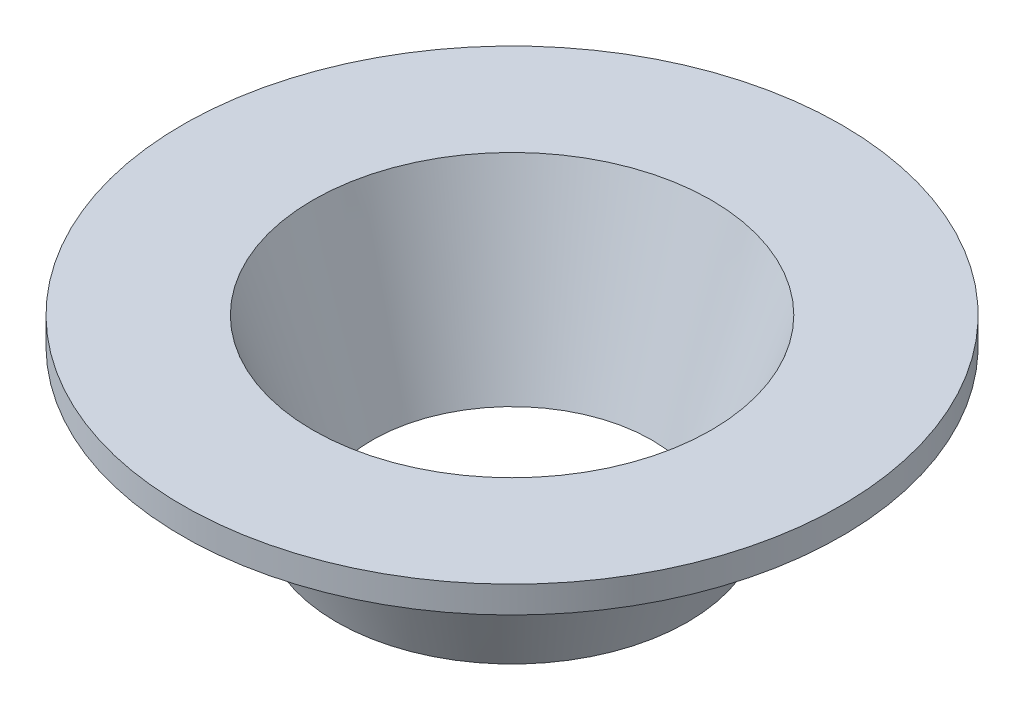
ISO-10303-21;
HEADER;
FILE_DESCRIPTION(('STEP AP214'),'2;1');
FILE_NAME('part.step','',(''),(''),'','','');
FILE_SCHEMA(('AUTOMOTIVE_DESIGN { 1 0 10303 214 1 1 1 1 }'));
ENDSEC;
DATA;
#1=APPLICATION_CONTEXT('core data for automotive mechanical design processes');
#2=APPLICATION_PROTOCOL_DEFINITION('international standard','automotive_design',2000,#1);
#3=PRODUCT_CONTEXT('',#1,'mechanical');
#4=PRODUCT('Part','Part','',(#3));
#5=PRODUCT_RELATED_PRODUCT_CATEGORY('part','',(#4));
#6=PRODUCT_DEFINITION_FORMATION('','',#4);
#7=PRODUCT_DEFINITION_CONTEXT('part definition',#1,'design');
#8=PRODUCT_DEFINITION('design','',#6,#7);
#9=PRODUCT_DEFINITION_SHAPE('','',#8);
#10=(LENGTH_UNIT() NAMED_UNIT(*) SI_UNIT(.MILLI.,.METRE.));
#11=(NAMED_UNIT(*) PLANE_ANGLE_UNIT() SI_UNIT($,.RADIAN.));
#12=(NAMED_UNIT(*) SI_UNIT($,.STERADIAN.) SOLID_ANGLE_UNIT());
#13=UNCERTAINTY_MEASURE_WITH_UNIT(LENGTH_MEASURE(1.E-05),#10,'distance_accuracy_value','');
#14=(GEOMETRIC_REPRESENTATION_CONTEXT(3) GLOBAL_UNCERTAINTY_ASSIGNED_CONTEXT((#13)) GLOBAL_UNIT_ASSIGNED_CONTEXT((#10,
#11,#12)) REPRESENTATION_CONTEXT('',''));
#15=CARTESIAN_POINT('',(0.,0.,0.));
#16=DIRECTION('',(0.,0.,1.));
#17=DIRECTION('',(1.,0.,0.));
#18=AXIS2_PLACEMENT_3D('',#15,#16,#17);
#19=CARTESIAN_POINT('',(5.85,0.,0.));
#20=DIRECTION('',(0.,1.,0.));
#21=DIRECTION('',(0.,0.,1.));
#22=AXIS2_PLACEMENT_3D('',#19,#20,#21);
#23=CONICAL_SURFACE('',#22,7.85,0.321750554396642);
#24=CARTESIAN_POINT('',(5.85,10.,0.));
#25=DIRECTION('',(0.,-1.,0.));
#26=DIRECTION('',(0.,0.,-1.));
#27=AXIS2_PLACEMENT_3D('',#24,#25,#26);
#28=CIRCLE('',#27,11.1833333333333);
#29=CARTESIAN_POINT('',(5.85,10.,-11.1833333333333));
#30=VERTEX_POINT('',#29);
#31=EDGE_CURVE('E59',#30,#30,#28,.T.);
#32=ORIENTED_EDGE('',*,*,#31,.F.);
#33=EDGE_LOOP('',(#32));
#34=FACE_BOUND('',#33,.T.);
#35=CARTESIAN_POINT('',(5.85,0.,0.));
#36=DIRECTION('',(0.,-1.,0.));
#37=DIRECTION('',(0.,0.,-1.));
#38=AXIS2_PLACEMENT_3D('',#35,#36,#37);
#39=CIRCLE('',#38,7.85);
#40=CARTESIAN_POINT('',(5.85,0.,-7.85));
#41=VERTEX_POINT('',#40);
#42=EDGE_CURVE('E10',#41,#41,#39,.T.);
#43=ORIENTED_EDGE('',*,*,#42,.T.);
#44=EDGE_LOOP('',(#43));
#45=FACE_BOUND('',#44,.T.);
#46=ADVANCED_FACE('F37',(#34,#45),#23,.F.);
#47=CARTESIAN_POINT('',(-2.,0.,0.));
#48=DIRECTION('',(0.,1.,0.));
#49=DIRECTION('',(0.,0.,1.));
#50=AXIS2_PLACEMENT_3D('',#47,#48,#49);
#51=PLANE('',#50);
#52=ORIENTED_EDGE('',*,*,#42,.F.);
#53=EDGE_LOOP('',(#52));
#54=FACE_BOUND('',#53,.T.);
#55=CARTESIAN_POINT('',(5.85,0.,0.));
#56=DIRECTION('',(0.,-1.,0.));
#57=DIRECTION('',(0.,0.,-1.));
#58=AXIS2_PLACEMENT_3D('',#55,#56,#57);
#59=CIRCLE('',#58,9.85);
#60=CARTESIAN_POINT('',(5.85,0.,-9.85));
#61=VERTEX_POINT('',#60);
#62=EDGE_CURVE('E43',#61,#61,#59,.T.);
#63=ORIENTED_EDGE('',*,*,#62,.T.);
#64=EDGE_LOOP('',(#63));
#65=FACE_BOUND('',#64,.T.);
#66=ADVANCED_FACE('F66',(#54,#65),#51,.F.);
#67=CARTESIAN_POINT('',(5.85,8.5,0.));
#68=DIRECTION('',(0.,1.,0.));
#69=DIRECTION('',(0.,0.,1.));
#70=AXIS2_PLACEMENT_3D('',#67,#68,#69);
#71=CONICAL_SURFACE('',#70,13.,0.354897222889823);
#72=ORIENTED_EDGE('',*,*,#62,.F.);
#73=EDGE_LOOP('',(#72));
#74=FACE_BOUND('',#73,.T.);
#75=CARTESIAN_POINT('',(5.85,8.5,0.));
#76=DIRECTION('',(0.,-1.,0.));
#77=DIRECTION('',(0.,0.,-1.));
#78=AXIS2_PLACEMENT_3D('',#75,#76,#77);
#79=CIRCLE('',#78,13.);
#80=CARTESIAN_POINT('',(5.85,8.5,-13.));
#81=VERTEX_POINT('',#80);
#82=EDGE_CURVE('E47',#81,#81,#79,.T.);
#83=ORIENTED_EDGE('',*,*,#82,.T.);
#84=EDGE_LOOP('',(#83));
#85=FACE_BOUND('',#84,.T.);
#86=ADVANCED_FACE('F70',(#74,#85),#71,.T.);
#87=CARTESIAN_POINT('',(-7.15,8.5,0.));
#88=DIRECTION('',(0.,1.,0.));
#89=DIRECTION('',(0.,0.,1.));
#90=AXIS2_PLACEMENT_3D('',#87,#88,#89);
#91=PLANE('',#90);
#92=ORIENTED_EDGE('',*,*,#82,.F.);
#93=EDGE_LOOP('',(#92));
#94=FACE_BOUND('',#93,.T.);
#95=CARTESIAN_POINT('',(5.85,8.5,0.));
#96=DIRECTION('',(0.,-1.,0.));
#97=DIRECTION('',(0.,0.,-1.));
#98=AXIS2_PLACEMENT_3D('',#95,#96,#97);
#99=CIRCLE('',#98,18.5);
#100=CARTESIAN_POINT('',(5.85,8.5,-18.5));
#101=VERTEX_POINT('',#100);
#102=EDGE_CURVE('E51',#101,#101,#99,.T.);
#103=ORIENTED_EDGE('',*,*,#102,.T.);
#104=EDGE_LOOP('',(#103));
#105=FACE_BOUND('',#104,.T.);
#106=ADVANCED_FACE('F75',(#94,#105),#91,.F.);
#107=CARTESIAN_POINT('',(5.85,-1.30865213887545,0.));
#108=DIRECTION('',(0.,-1.,0.));
#109=DIRECTION('',(0.,0.,-1.));
#110=AXIS2_PLACEMENT_3D('',#107,#108,#109);
#111=CYLINDRICAL_SURFACE('',#110,18.5);
#112=ORIENTED_EDGE('',*,*,#102,.F.);
#113=EDGE_LOOP('',(#112));
#114=FACE_BOUND('',#113,.T.);
#115=CARTESIAN_POINT('',(5.85,10.,0.));
#116=DIRECTION('',(0.,-1.,0.));
#117=DIRECTION('',(0.,0.,-1.));
#118=AXIS2_PLACEMENT_3D('',#115,#116,#117);
#119=CIRCLE('',#118,18.5);
#120=CARTESIAN_POINT('',(5.85,10.,-18.5));
#121=VERTEX_POINT('',#120);
#122=EDGE_CURVE('E56',#121,#121,#119,.T.);
#123=ORIENTED_EDGE('',*,*,#122,.T.);
#124=EDGE_LOOP('',(#123));
#125=FACE_BOUND('',#124,.T.);
#126=ADVANCED_FACE('F81',(#114,#125),#111,.T.);
#127=CARTESIAN_POINT('',(-12.65,10.,0.));
#128=DIRECTION('',(0.,-1.,0.));
#129=DIRECTION('',(0.,0.,-1.));
#130=AXIS2_PLACEMENT_3D('',#127,#128,#129);
#131=PLANE('',#130);
#132=ORIENTED_EDGE('',*,*,#122,.F.);
#133=EDGE_LOOP('',(#132));
#134=FACE_BOUND('',#133,.T.);
#135=ORIENTED_EDGE('',*,*,#31,.T.);
#136=EDGE_LOOP('',(#135));
#137=FACE_BOUND('',#136,.T.);
#138=ADVANCED_FACE('F63',(#134,#137),#131,.F.);
#139=CLOSED_SHELL('',(#46,#66,#86,#106,#126,#138));
#140=MANIFOLD_SOLID_BREP('B2',#139);
#141=ADVANCED_BREP_SHAPE_REPRESENTATION('',(#18,#140),#14);
#142=SHAPE_DEFINITION_REPRESENTATION(#9,#141);
ENDSEC;
END-ISO-10303-21;
